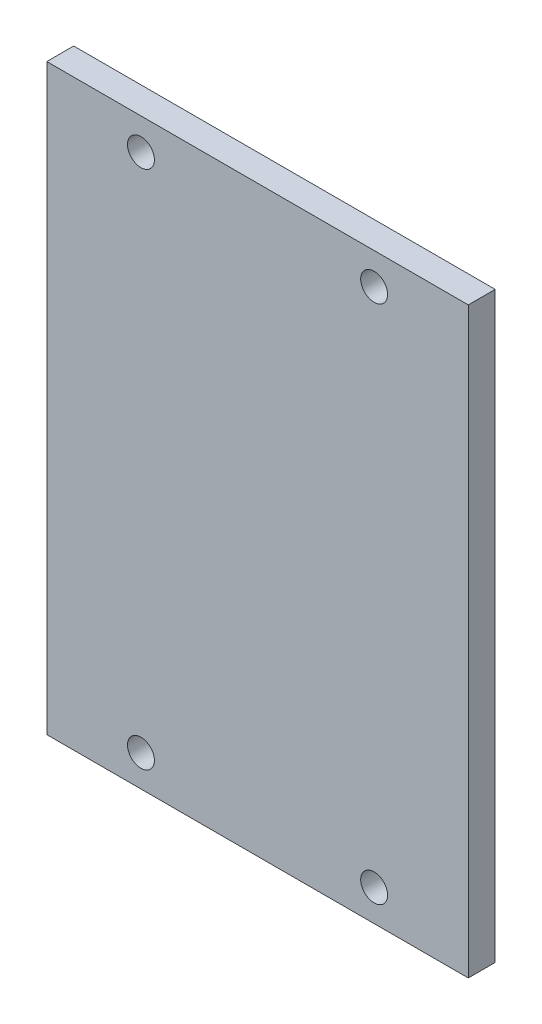
ISO-10303-21;
HEADER;
FILE_DESCRIPTION(('STEP AP214'),'2;1');
FILE_NAME('part.step','',(''),(''),'','','');
FILE_SCHEMA(('AUTOMOTIVE_DESIGN { 1 0 10303 214 1 1 1 1 }'));
ENDSEC;
DATA;
#1=APPLICATION_CONTEXT('core data for automotive mechanical design processes');
#2=APPLICATION_PROTOCOL_DEFINITION('international standard','automotive_design',2000,#1);
#3=PRODUCT_CONTEXT('',#1,'mechanical');
#4=PRODUCT('Part','Part','',(#3));
#5=PRODUCT_RELATED_PRODUCT_CATEGORY('part','',(#4));
#6=PRODUCT_DEFINITION_FORMATION('','',#4);
#7=PRODUCT_DEFINITION_CONTEXT('part definition',#1,'design');
#8=PRODUCT_DEFINITION('design','',#6,#7);
#9=PRODUCT_DEFINITION_SHAPE('','',#8);
#10=(LENGTH_UNIT() NAMED_UNIT(*) SI_UNIT(.MILLI.,.METRE.));
#11=(NAMED_UNIT(*) PLANE_ANGLE_UNIT() SI_UNIT($,.RADIAN.));
#12=(NAMED_UNIT(*) SI_UNIT($,.STERADIAN.) SOLID_ANGLE_UNIT());
#13=UNCERTAINTY_MEASURE_WITH_UNIT(LENGTH_MEASURE(1.E-05),#10,'distance_accuracy_value','');
#14=(GEOMETRIC_REPRESENTATION_CONTEXT(3) GLOBAL_UNCERTAINTY_ASSIGNED_CONTEXT((#13)) GLOBAL_UNIT_ASSIGNED_CONTEXT((#10,
#11,#12)) REPRESENTATION_CONTEXT('',''));
#15=CARTESIAN_POINT('',(0.,0.,0.));
#16=DIRECTION('',(0.,0.,1.));
#17=DIRECTION('',(1.,0.,0.));
#18=AXIS2_PLACEMENT_3D('',#15,#16,#17);
#19=CARTESIAN_POINT('',(23.5,-32.5,3.));
#20=DIRECTION('',(-1.,0.,0.));
#21=DIRECTION('',(0.,0.,1.));
#22=AXIS2_PLACEMENT_3D('',#19,#20,#21);
#23=PLANE('',#22);
#24=DIRECTION('',(0.,1.,0.));
#25=VECTOR('',#24,1.);
#26=CARTESIAN_POINT('',(23.5,-32.5,0.));
#27=LINE('',#26,#25);
#28=CARTESIAN_POINT('',(23.5,-32.5,0.));
#29=VERTEX_POINT('',#28);
#30=CARTESIAN_POINT('',(23.5,32.5,0.));
#31=VERTEX_POINT('',#30);
#32=EDGE_CURVE('E114',#29,#31,#27,.T.);
#33=ORIENTED_EDGE('',*,*,#32,.T.);
#34=DIRECTION('',(0.,0.,-1.));
#35=VECTOR('',#34,1.);
#36=CARTESIAN_POINT('',(23.5,32.5,3.));
#37=LINE('',#36,#35);
#38=CARTESIAN_POINT('',(23.5,32.5,3.));
#39=VERTEX_POINT('',#38);
#40=EDGE_CURVE('E11',#39,#31,#37,.T.);
#41=ORIENTED_EDGE('',*,*,#40,.F.);
#42=DIRECTION('',(0.,1.,0.));
#43=VECTOR('',#42,1.);
#44=CARTESIAN_POINT('',(23.5,-32.5,3.));
#45=LINE('',#44,#43);
#46=CARTESIAN_POINT('',(23.5,-32.5,3.));
#47=VERTEX_POINT('',#46);
#48=EDGE_CURVE('E97',#47,#39,#45,.T.);
#49=ORIENTED_EDGE('',*,*,#48,.F.);
#50=DIRECTION('',(0.,0.,-1.));
#51=VECTOR('',#50,1.);
#52=CARTESIAN_POINT('',(23.5,-32.5,3.));
#53=LINE('',#52,#51);
#54=EDGE_CURVE('E110',#47,#29,#53,.T.);
#55=ORIENTED_EDGE('',*,*,#54,.T.);
#56=EDGE_LOOP('',(#33,#41,#49,#55));
#57=FACE_BOUND('',#56,.T.);
#58=ADVANCED_FACE('F43',(#57),#23,.F.);
#59=CARTESIAN_POINT('',(-23.5,32.5,3.));
#60=DIRECTION('',(0.,-1.,0.));
#61=DIRECTION('',(0.,0.,-1.));
#62=AXIS2_PLACEMENT_3D('',#59,#60,#61);
#63=PLANE('',#62);
#64=DIRECTION('',(-1.,0.,0.));
#65=VECTOR('',#64,1.);
#66=CARTESIAN_POINT('',(-23.5,32.5,0.));
#67=LINE('',#66,#65);
#68=CARTESIAN_POINT('',(-23.5,32.5,0.));
#69=VERTEX_POINT('',#68);
#70=EDGE_CURVE('E102',#31,#69,#67,.T.);
#71=ORIENTED_EDGE('',*,*,#70,.T.);
#72=DIRECTION('',(0.,0.,-1.));
#73=VECTOR('',#72,1.);
#74=CARTESIAN_POINT('',(-23.5,32.5,3.));
#75=LINE('',#74,#73);
#76=CARTESIAN_POINT('',(-23.5,32.5,3.));
#77=VERTEX_POINT('',#76);
#78=EDGE_CURVE('E53',#77,#69,#75,.T.);
#79=ORIENTED_EDGE('',*,*,#78,.F.);
#80=DIRECTION('',(-1.,0.,0.));
#81=VECTOR('',#80,1.);
#82=CARTESIAN_POINT('',(-23.5,32.5,3.));
#83=LINE('',#82,#81);
#84=EDGE_CURVE('E92',#39,#77,#83,.T.);
#85=ORIENTED_EDGE('',*,*,#84,.F.);
#86=ORIENTED_EDGE('',*,*,#40,.T.);
#87=EDGE_LOOP('',(#71,#79,#85,#86));
#88=FACE_BOUND('',#87,.T.);
#89=ADVANCED_FACE('F101',(#88),#63,.F.);
#90=CARTESIAN_POINT('',(-23.5,-32.5,3.));
#91=DIRECTION('',(1.,0.,0.));
#92=DIRECTION('',(0.,0.,-1.));
#93=AXIS2_PLACEMENT_3D('',#90,#91,#92);
#94=PLANE('',#93);
#95=DIRECTION('',(0.,-1.,0.));
#96=VECTOR('',#95,1.);
#97=CARTESIAN_POINT('',(-23.5,-32.5,0.));
#98=LINE('',#97,#96);
#99=CARTESIAN_POINT('',(-23.5,-32.5,0.));
#100=VERTEX_POINT('',#99);
#101=EDGE_CURVE('E79',#69,#100,#98,.T.);
#102=ORIENTED_EDGE('',*,*,#101,.T.);
#103=DIRECTION('',(0.,0.,-1.));
#104=VECTOR('',#103,1.);
#105=CARTESIAN_POINT('',(-23.5,-32.5,3.));
#106=LINE('',#105,#104);
#107=CARTESIAN_POINT('',(-23.5,-32.5,3.));
#108=VERTEX_POINT('',#107);
#109=EDGE_CURVE('E104',#108,#100,#106,.T.);
#110=ORIENTED_EDGE('',*,*,#109,.F.);
#111=DIRECTION('',(0.,-1.,0.));
#112=VECTOR('',#111,1.);
#113=CARTESIAN_POINT('',(-23.5,-32.5,3.));
#114=LINE('',#113,#112);
#115=EDGE_CURVE('E95',#77,#108,#114,.T.);
#116=ORIENTED_EDGE('',*,*,#115,.F.);
#117=ORIENTED_EDGE('',*,*,#78,.T.);
#118=EDGE_LOOP('',(#102,#110,#116,#117));
#119=FACE_BOUND('',#118,.T.);
#120=ADVANCED_FACE('F106',(#119),#94,.F.);
#121=CARTESIAN_POINT('',(-23.5,-32.5,3.));
#122=DIRECTION('',(0.,1.,0.));
#123=DIRECTION('',(0.,0.,1.));
#124=AXIS2_PLACEMENT_3D('',#121,#122,#123);
#125=PLANE('',#124);
#126=DIRECTION('',(1.,0.,0.));
#127=VECTOR('',#126,1.);
#128=CARTESIAN_POINT('',(-23.5,-32.5,0.));
#129=LINE('',#128,#127);
#130=EDGE_CURVE('E85',#100,#29,#129,.T.);
#131=ORIENTED_EDGE('',*,*,#130,.T.);
#132=ORIENTED_EDGE('',*,*,#54,.F.);
#133=DIRECTION('',(1.,0.,0.));
#134=VECTOR('',#133,1.);
#135=CARTESIAN_POINT('',(-23.5,-32.5,3.));
#136=LINE('',#135,#134);
#137=EDGE_CURVE('E62',#108,#47,#136,.T.);
#138=ORIENTED_EDGE('',*,*,#137,.F.);
#139=ORIENTED_EDGE('',*,*,#109,.T.);
#140=EDGE_LOOP('',(#131,#132,#138,#139));
#141=FACE_BOUND('',#140,.T.);
#142=ADVANCED_FACE('F165',(#141),#125,.F.);
#143=CARTESIAN_POINT('',(0.,0.,3.));
#144=DIRECTION('',(0.,0.,-1.));
#145=DIRECTION('',(-1.,0.,0.));
#146=AXIS2_PLACEMENT_3D('',#143,#144,#145);
#147=PLANE('',#146);
#148=CARTESIAN_POINT('',(-13.,-29.,3.));
#149=DIRECTION('',(0.,0.,1.));
#150=DIRECTION('',(1.,0.,0.));
#151=AXIS2_PLACEMENT_3D('',#148,#149,#150);
#152=CIRCLE('',#151,1.49999999999999);
#153=CARTESIAN_POINT('',(-11.5,-29.,3.));
#154=VERTEX_POINT('',#153);
#155=EDGE_CURVE('E153',#154,#154,#152,.T.);
#156=ORIENTED_EDGE('',*,*,#155,.F.);
#157=EDGE_LOOP('',(#156));
#158=FACE_BOUND('',#157,.T.);
#159=CARTESIAN_POINT('',(13.,-29.,3.));
#160=DIRECTION('',(0.,0.,1.));
#161=DIRECTION('',(1.,0.,0.));
#162=AXIS2_PLACEMENT_3D('',#159,#160,#161);
#163=CIRCLE('',#162,1.49999999999999);
#164=CARTESIAN_POINT('',(14.5,-29.,3.));
#165=VERTEX_POINT('',#164);
#166=EDGE_CURVE('E140',#165,#165,#163,.T.);
#167=ORIENTED_EDGE('',*,*,#166,.F.);
#168=EDGE_LOOP('',(#167));
#169=FACE_BOUND('',#168,.T.);
#170=CARTESIAN_POINT('',(13.,29.,3.));
#171=DIRECTION('',(0.,0.,1.));
#172=DIRECTION('',(1.,0.,0.));
#173=AXIS2_PLACEMENT_3D('',#170,#171,#172);
#174=CIRCLE('',#173,1.49999999999999);
#175=CARTESIAN_POINT('',(14.5,29.,3.));
#176=VERTEX_POINT('',#175);
#177=EDGE_CURVE('E136',#176,#176,#174,.T.);
#178=ORIENTED_EDGE('',*,*,#177,.F.);
#179=EDGE_LOOP('',(#178));
#180=FACE_BOUND('',#179,.T.);
#181=CARTESIAN_POINT('',(-13.,29.,3.));
#182=DIRECTION('',(0.,0.,1.));
#183=DIRECTION('',(1.,0.,0.));
#184=AXIS2_PLACEMENT_3D('',#181,#182,#183);
#185=CIRCLE('',#184,1.49999999999999);
#186=CARTESIAN_POINT('',(-11.5,29.,3.));
#187=VERTEX_POINT('',#186);
#188=EDGE_CURVE('E132',#187,#187,#185,.T.);
#189=ORIENTED_EDGE('',*,*,#188,.F.);
#190=EDGE_LOOP('',(#189));
#191=FACE_BOUND('',#190,.T.);
#192=ORIENTED_EDGE('',*,*,#48,.T.);
#193=ORIENTED_EDGE('',*,*,#84,.T.);
#194=ORIENTED_EDGE('',*,*,#115,.T.);
#195=ORIENTED_EDGE('',*,*,#137,.T.);
#196=EDGE_LOOP('',(#192,#193,#194,#195));
#197=FACE_BOUND('',#196,.T.);
#198=ADVANCED_FACE('F93',(#158,#169,#180,#191,#197),#147,.F.);
#199=CARTESIAN_POINT('',(0.,0.,0.));
#200=DIRECTION('',(0.,0.,-1.));
#201=DIRECTION('',(-1.,0.,0.));
#202=AXIS2_PLACEMENT_3D('',#199,#200,#201);
#203=PLANE('',#202);
#204=CARTESIAN_POINT('',(-13.,-29.,0.));
#205=DIRECTION('',(0.,0.,-1.));
#206=DIRECTION('',(-1.,0.,0.));
#207=AXIS2_PLACEMENT_3D('',#204,#205,#206);
#208=CIRCLE('',#207,1.49999999999999);
#209=CARTESIAN_POINT('',(-14.5,-29.,0.));
#210=VERTEX_POINT('',#209);
#211=EDGE_CURVE('E46',#210,#210,#208,.T.);
#212=ORIENTED_EDGE('',*,*,#211,.F.);
#213=EDGE_LOOP('',(#212));
#214=FACE_BOUND('',#213,.T.);
#215=CARTESIAN_POINT('',(13.,-29.,0.));
#216=DIRECTION('',(0.,0.,-1.));
#217=DIRECTION('',(-1.,0.,0.));
#218=AXIS2_PLACEMENT_3D('',#215,#216,#217);
#219=CIRCLE('',#218,1.49999999999999);
#220=CARTESIAN_POINT('',(11.5,-29.,0.));
#221=VERTEX_POINT('',#220);
#222=EDGE_CURVE('E137',#221,#221,#219,.T.);
#223=ORIENTED_EDGE('',*,*,#222,.F.);
#224=EDGE_LOOP('',(#223));
#225=FACE_BOUND('',#224,.T.);
#226=CARTESIAN_POINT('',(13.,29.,0.));
#227=DIRECTION('',(0.,0.,-1.));
#228=DIRECTION('',(-1.,0.,0.));
#229=AXIS2_PLACEMENT_3D('',#226,#227,#228);
#230=CIRCLE('',#229,1.49999999999999);
#231=CARTESIAN_POINT('',(11.5,29.,0.));
#232=VERTEX_POINT('',#231);
#233=EDGE_CURVE('E133',#232,#232,#230,.T.);
#234=ORIENTED_EDGE('',*,*,#233,.F.);
#235=EDGE_LOOP('',(#234));
#236=FACE_BOUND('',#235,.T.);
#237=CARTESIAN_POINT('',(-13.,29.,0.));
#238=DIRECTION('',(0.,0.,-1.));
#239=DIRECTION('',(-1.,0.,0.));
#240=AXIS2_PLACEMENT_3D('',#237,#238,#239);
#241=CIRCLE('',#240,1.49999999999999);
#242=CARTESIAN_POINT('',(-14.5,29.,0.));
#243=VERTEX_POINT('',#242);
#244=EDGE_CURVE('E118',#243,#243,#241,.T.);
#245=ORIENTED_EDGE('',*,*,#244,.F.);
#246=EDGE_LOOP('',(#245));
#247=FACE_BOUND('',#246,.T.);
#248=ORIENTED_EDGE('',*,*,#32,.F.);
#249=ORIENTED_EDGE('',*,*,#130,.F.);
#250=ORIENTED_EDGE('',*,*,#101,.F.);
#251=ORIENTED_EDGE('',*,*,#70,.F.);
#252=EDGE_LOOP('',(#248,#249,#250,#251));
#253=FACE_BOUND('',#252,.T.);
#254=ADVANCED_FACE('F164',(#214,#225,#236,#247,#253),#203,.T.);
#255=CARTESIAN_POINT('',(-13.,29.,3.));
#256=DIRECTION('',(0.,0.,1.));
#257=DIRECTION('',(1.,0.,0.));
#258=AXIS2_PLACEMENT_3D('',#255,#256,#257);
#259=CYLINDRICAL_SURFACE('',#258,1.49999999999999);
#260=ORIENTED_EDGE('',*,*,#244,.T.);
#261=EDGE_LOOP('',(#260));
#262=FACE_BOUND('',#261,.T.);
#263=ORIENTED_EDGE('',*,*,#188,.T.);
#264=EDGE_LOOP('',(#263));
#265=FACE_BOUND('',#264,.T.);
#266=ADVANCED_FACE('F161',(#262,#265),#259,.F.);
#267=CARTESIAN_POINT('',(13.,29.,3.));
#268=DIRECTION('',(0.,0.,1.));
#269=DIRECTION('',(1.,0.,0.));
#270=AXIS2_PLACEMENT_3D('',#267,#268,#269);
#271=CYLINDRICAL_SURFACE('',#270,1.49999999999999);
#272=ORIENTED_EDGE('',*,*,#233,.T.);
#273=EDGE_LOOP('',(#272));
#274=FACE_BOUND('',#273,.T.);
#275=ORIENTED_EDGE('',*,*,#177,.T.);
#276=EDGE_LOOP('',(#275));
#277=FACE_BOUND('',#276,.T.);
#278=ADVANCED_FACE('F217',(#274,#277),#271,.F.);
#279=CARTESIAN_POINT('',(13.,-29.,3.));
#280=DIRECTION('',(0.,0.,1.));
#281=DIRECTION('',(1.,0.,0.));
#282=AXIS2_PLACEMENT_3D('',#279,#280,#281);
#283=CYLINDRICAL_SURFACE('',#282,1.49999999999999);
#284=ORIENTED_EDGE('',*,*,#222,.T.);
#285=EDGE_LOOP('',(#284));
#286=FACE_BOUND('',#285,.T.);
#287=ORIENTED_EDGE('',*,*,#166,.T.);
#288=EDGE_LOOP('',(#287));
#289=FACE_BOUND('',#288,.T.);
#290=ADVANCED_FACE('F227',(#286,#289),#283,.F.);
#291=CARTESIAN_POINT('',(-13.,-29.,3.));
#292=DIRECTION('',(0.,0.,1.));
#293=DIRECTION('',(1.,0.,0.));
#294=AXIS2_PLACEMENT_3D('',#291,#292,#293);
#295=CYLINDRICAL_SURFACE('',#294,1.49999999999999);
#296=ORIENTED_EDGE('',*,*,#211,.T.);
#297=EDGE_LOOP('',(#296));
#298=FACE_BOUND('',#297,.T.);
#299=ORIENTED_EDGE('',*,*,#155,.T.);
#300=EDGE_LOOP('',(#299));
#301=FACE_BOUND('',#300,.T.);
#302=ADVANCED_FACE('F238',(#298,#301),#295,.F.);
#303=CLOSED_SHELL('',(#58,#89,#120,#142,#198,#254,#266,#278,#290,#302));
#304=MANIFOLD_SOLID_BREP('B2',#303);
#305=ADVANCED_BREP_SHAPE_REPRESENTATION('',(#18,#304),#14);
#306=SHAPE_DEFINITION_REPRESENTATION(#9,#305);
ENDSEC;
END-ISO-10303-21;
